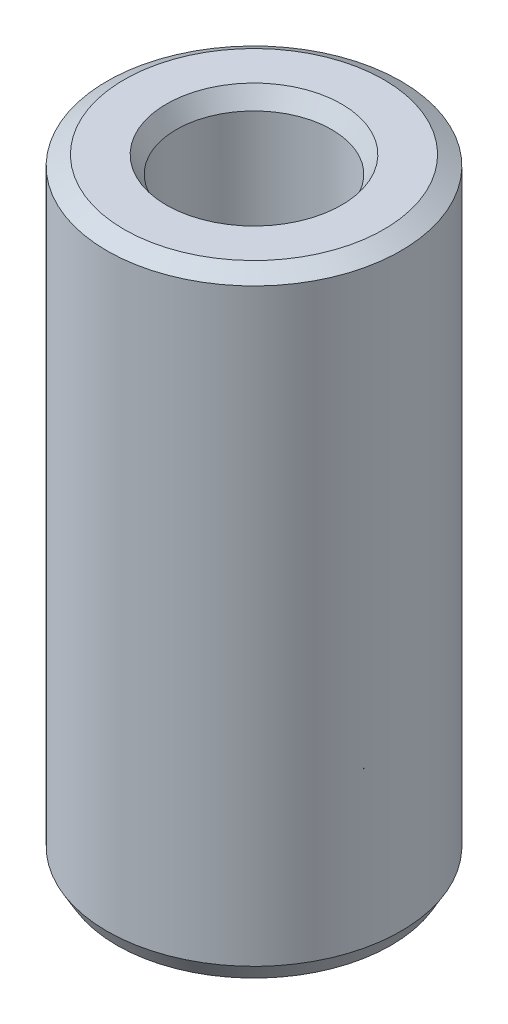
ISO-10303-21;
HEADER;
FILE_DESCRIPTION(('STEP AP214'),'2;1');
FILE_NAME('part.step','',(''),(''),'','','');
FILE_SCHEMA(('AUTOMOTIVE_DESIGN { 1 0 10303 214 1 1 1 1 }'));
ENDSEC;
DATA;
#1=APPLICATION_CONTEXT('core data for automotive mechanical design processes');
#2=APPLICATION_PROTOCOL_DEFINITION('international standard','automotive_design',2000,#1);
#3=PRODUCT_CONTEXT('',#1,'mechanical');
#4=PRODUCT('Part','Part','',(#3));
#5=PRODUCT_RELATED_PRODUCT_CATEGORY('part','',(#4));
#6=PRODUCT_DEFINITION_FORMATION('','',#4);
#7=PRODUCT_DEFINITION_CONTEXT('part definition',#1,'design');
#8=PRODUCT_DEFINITION('design','',#6,#7);
#9=PRODUCT_DEFINITION_SHAPE('','',#8);
#10=(LENGTH_UNIT() NAMED_UNIT(*) SI_UNIT(.MILLI.,.METRE.));
#11=(NAMED_UNIT(*) PLANE_ANGLE_UNIT() SI_UNIT($,.RADIAN.));
#12=(NAMED_UNIT(*) SI_UNIT($,.STERADIAN.) SOLID_ANGLE_UNIT());
#13=UNCERTAINTY_MEASURE_WITH_UNIT(LENGTH_MEASURE(1.E-05),#10,'distance_accuracy_value','');
#14=(GEOMETRIC_REPRESENTATION_CONTEXT(3) GLOBAL_UNCERTAINTY_ASSIGNED_CONTEXT((#13)) GLOBAL_UNIT_ASSIGNED_CONTEXT((#10,
#11,#12)) REPRESENTATION_CONTEXT('',''));
#15=CARTESIAN_POINT('',(0.,0.,0.));
#16=DIRECTION('',(0.,0.,1.));
#17=DIRECTION('',(1.,0.,0.));
#18=AXIS2_PLACEMENT_3D('',#15,#16,#17);
#19=CARTESIAN_POINT('',(0.,115.309120198589,0.));
#20=DIRECTION('',(0.,-1.,0.));
#21=DIRECTION('',(0.,0.,-1.));
#22=AXIS2_PLACEMENT_3D('',#19,#20,#21);
#23=CYLINDRICAL_SURFACE('',#22,27.5);
#24=CARTESIAN_POINT('',(0.,3.21119112476283,0.));
#25=DIRECTION('',(0.,1.,0.));
#26=DIRECTION('',(0.,0.,1.));
#27=AXIS2_PLACEMENT_3D('',#24,#25,#26);
#28=CIRCLE('',#27,27.5);
#29=CARTESIAN_POINT('',(0.,3.21119112476283,-27.5));
#30=VERTEX_POINT('',#29);
#31=EDGE_CURVE('E10',#30,#30,#28,.T.);
#32=CARTESIAN_POINT('',(0.,113.455138138288,0.));
#33=DIRECTION('',(0.,1.,0.));
#34=DIRECTION('',(0.,0.,1.));
#35=AXIS2_PLACEMENT_3D('',#32,#33,#34);
#36=CIRCLE('',#35,27.5);
#37=CARTESIAN_POINT('',(0.,113.455138138288,-27.5));
#38=VERTEX_POINT('',#37);
#39=EDGE_CURVE('E50',#38,#38,#36,.F.);
#40=CARTESIAN_POINT('',(0.,3.21119112476283,-27.5));
#41=CARTESIAN_POINT('',(0.,4.35956557282038,-27.5));
#42=CARTESIAN_POINT('',(0.,5.50794002087793,-27.5));
#43=CARTESIAN_POINT('',(0.,7.80468891699304,-27.5));
#44=CARTESIAN_POINT('',(0.,8.9530633650506,-27.5));
#45=CARTESIAN_POINT('',(0.,11.2498122611657,-27.5));
#46=CARTESIAN_POINT('',(0.,12.3981867092233,-27.5));
#47=CARTESIAN_POINT('',(0.,14.6949356053384,-27.5));
#48=CARTESIAN_POINT('',(0.,15.8433100533959,-27.5));
#49=CARTESIAN_POINT('',(0.,18.140058949511,-27.5));
#50=CARTESIAN_POINT('',(0.,19.2884333975686,-27.5));
#51=CARTESIAN_POINT('',(0.,21.5851822936837,-27.5));
#52=CARTESIAN_POINT('',(0.,22.7335567417412,-27.5));
#53=CARTESIAN_POINT('',(0.,25.0303056378564,-27.5));
#54=CARTESIAN_POINT('',(0.,26.1786800859139,-27.5));
#55=CARTESIAN_POINT('',(0.,28.475428982029,-27.5));
#56=CARTESIAN_POINT('',(0.,29.6238034300866,-27.5));
#57=CARTESIAN_POINT('',(0.,31.9205523262017,-27.5));
#58=CARTESIAN_POINT('',(0.,33.0689267742592,-27.5));
#59=CARTESIAN_POINT('',(0.,35.3656756703743,-27.5));
#60=CARTESIAN_POINT('',(0.,36.5140501184319,-27.5));
#61=CARTESIAN_POINT('',(0.,38.810799014547,-27.5));
#62=CARTESIAN_POINT('',(0.,39.9591734626045,-27.5));
#63=CARTESIAN_POINT('',(0.,42.2559223587197,-27.5));
#64=CARTESIAN_POINT('',(0.,43.4042968067772,-27.5));
#65=CARTESIAN_POINT('',(0.,45.7010457028923,-27.5));
#66=CARTESIAN_POINT('',(0.,46.8494201509499,-27.5));
#67=CARTESIAN_POINT('',(0.,49.146169047065,-27.5));
#68=CARTESIAN_POINT('',(0.,50.2945434951225,-27.5));
#69=CARTESIAN_POINT('',(0.,52.5912923912376,-27.5));
#70=CARTESIAN_POINT('',(0.,53.7396668392952,-27.5));
#71=CARTESIAN_POINT('',(0.,56.0364157354103,-27.5));
#72=CARTESIAN_POINT('',(0.,57.1847901834678,-27.5));
#73=CARTESIAN_POINT('',(0.,59.481539079583,-27.5));
#74=CARTESIAN_POINT('',(0.,60.6299135276405,-27.5));
#75=CARTESIAN_POINT('',(0.,62.9266624237556,-27.5));
#76=CARTESIAN_POINT('',(0.,64.0750368718132,-27.5));
#77=CARTESIAN_POINT('',(0.,66.3717857679283,-27.5));
#78=CARTESIAN_POINT('',(0.,67.5201602159858,-27.5));
#79=CARTESIAN_POINT('',(0.,69.8169091121009,-27.5));
#80=CARTESIAN_POINT('',(0.,70.9652835601585,-27.5));
#81=CARTESIAN_POINT('',(0.,73.2620324562736,-27.5));
#82=CARTESIAN_POINT('',(0.,74.4104069043311,-27.5));
#83=CARTESIAN_POINT('',(0.,76.7071558004462,-27.5));
#84=CARTESIAN_POINT('',(0.,77.8555302485038,-27.5));
#85=CARTESIAN_POINT('',(0.,80.1522791446189,-27.5));
#86=CARTESIAN_POINT('',(0.,81.3006535926765,-27.5));
#87=CARTESIAN_POINT('',(0.,83.5974024887916,-27.5));
#88=CARTESIAN_POINT('',(0.,84.7457769368491,-27.5));
#89=CARTESIAN_POINT('',(0.,87.0425258329642,-27.5));
#90=CARTESIAN_POINT('',(0.,88.1909002810218,-27.5));
#91=CARTESIAN_POINT('',(0.,90.4876491771369,-27.5));
#92=CARTESIAN_POINT('',(0.,91.6360236251944,-27.5));
#93=CARTESIAN_POINT('',(0.,93.9327725213095,-27.5));
#94=CARTESIAN_POINT('',(0.,95.0811469693671,-27.5));
#95=CARTESIAN_POINT('',(0.,97.3778958654822,-27.5));
#96=CARTESIAN_POINT('',(0.,98.5262703135398,-27.5));
#97=CARTESIAN_POINT('',(0.,100.823019209655,-27.5));
#98=CARTESIAN_POINT('',(0.,101.971393657712,-27.5));
#99=CARTESIAN_POINT('',(0.,104.268142553828,-27.5));
#100=CARTESIAN_POINT('',(0.,105.416517001885,-27.5));
#101=CARTESIAN_POINT('',(0.,107.713265898,-27.5));
#102=CARTESIAN_POINT('',(0.,108.861640346058,-27.5));
#103=CARTESIAN_POINT('',(0.,111.158389242173,-27.5));
#104=CARTESIAN_POINT('',(0.,112.30676369023,-27.5));
#105=CARTESIAN_POINT('',(0.,113.455138138288,-27.5));
#106=B_SPLINE_CURVE_WITH_KNOTS('',3,(#40,#41,#42,#43,#44,#45,#46,#47,#48,#49,#50,#51,#52,#53,
#54,#55,#56,#57,#58,#59,#60,#61,#62,#63,#64,#65,#66,#67,#68,#69,#70,#71,#72,#73,#74,#75,#76,#77,
#78,#79,#80,#81,#82,#83,#84,#85,#86,#87,#88,#89,#90,#91,#92,#93,#94,#95,#96,#97,#98,#99,#100,
#101,#102,#103,#104,#105),.UNSPECIFIED.,.F.,.F.,(4,2,2,2,2,2,2,2,2,2,2,2,2,2,2,2,2,2,2,2,2,2,2,
2,2,2,2,2,2,2,2,2,4),(0.,3.44512334417266,6.89024668834533,10.335370032518,13.7804933766906,
17.2256167208633,20.670740065036,24.1158634092086,27.5609867533813,31.0061100975539,
34.4512334417266,37.8963567858993,41.3414801300719,44.7866034742446,48.2317268184173,
51.6768501625899,55.1219735067626,58.5670968509352,62.0122201951079,65.4573435392806,
68.9024668834532,72.3475902276259,75.7927135717985,79.2378369159712,82.6829602601438,
86.1280836043165,89.5732069484892,93.0183302926618,96.4634536368345,99.9085769810071,
103.35370032518,106.798823669352,110.243947013525),.UNSPECIFIED.);
#107=EDGE_CURVE('BSEAM39',#30,#38,#106,.T.);
#108=ORIENTED_EDGE('',*,*,#31,.T.);
#109=ORIENTED_EDGE('',*,*,#39,.T.);
#110=ORIENTED_EDGE('',*,*,#107,.T.);
#111=ORIENTED_EDGE('',*,*,#107,.F.);
#112=EDGE_LOOP('',(#108,#110,#109,#111));
#113=FACE_BOUND('',#112,.T.);
#114=ADVANCED_FACE('F39',(#113),#23,.T.);
#115=CARTESIAN_POINT('',(0.,115.309120198589,0.));
#116=DIRECTION('',(0.,1.,0.));
#117=DIRECTION('',(0.,0.,1.));
#118=AXIS2_PLACEMENT_3D('',#115,#116,#117);
#119=PLANE('',#118);
#120=CARTESIAN_POINT('',(0.,115.309120198589,0.));
#121=DIRECTION('',(0.,1.,0.));
#122=DIRECTION('',(0.,0.,1.));
#123=AXIS2_PLACEMENT_3D('',#120,#121,#122);
#124=CIRCLE('',#123,16.390327319142);
#125=CARTESIAN_POINT('',(0.,115.309120198589,16.390327319142));
#126=VERTEX_POINT('',#125);
#127=EDGE_CURVE('E58',#126,#126,#124,.F.);
#128=ORIENTED_EDGE('',*,*,#127,.T.);
#129=EDGE_LOOP('',(#128));
#130=FACE_BOUND('',#129,.T.);
#131=CARTESIAN_POINT('',(0.,115.309120198589,0.));
#132=DIRECTION('',(0.,1.,0.));
#133=DIRECTION('',(0.,0.,1.));
#134=AXIS2_PLACEMENT_3D('',#131,#132,#133);
#135=CIRCLE('',#134,24.2888088752375);
#136=CARTESIAN_POINT('',(0.,115.309120198589,24.2888088752375));
#137=VERTEX_POINT('',#136);
#138=EDGE_CURVE('E61',#137,#137,#135,.T.);
#139=ORIENTED_EDGE('',*,*,#138,.T.);
#140=EDGE_LOOP('',(#139));
#141=FACE_BOUND('',#140,.T.);
#142=ADVANCED_FACE('F88',(#130,#141),#119,.T.);
#143=CARTESIAN_POINT('',(0.,0.,0.));
#144=DIRECTION('',(0.,1.,0.));
#145=DIRECTION('',(0.,0.,1.));
#146=AXIS2_PLACEMENT_3D('',#143,#144,#145);
#147=PLANE('',#146);
#148=CARTESIAN_POINT('',(0.,0.,0.));
#149=DIRECTION('',(0.,1.,0.));
#150=DIRECTION('',(0.,0.,1.));
#151=AXIS2_PLACEMENT_3D('',#148,#149,#150);
#152=CIRCLE('',#151,17.7475363836035);
#153=CARTESIAN_POINT('',(0.,0.,17.7475363836035));
#154=VERTEX_POINT('',#153);
#155=EDGE_CURVE('E51',#154,#154,#152,.T.);
#156=ORIENTED_EDGE('',*,*,#155,.T.);
#157=EDGE_LOOP('',(#156));
#158=FACE_BOUND('',#157,.T.);
#159=CARTESIAN_POINT('',(0.,0.,0.));
#160=DIRECTION('',(0.,1.,0.));
#161=DIRECTION('',(0.,0.,1.));
#162=AXIS2_PLACEMENT_3D('',#159,#160,#161);
#163=CIRCLE('',#162,25.6460179396988);
#164=CARTESIAN_POINT('',(0.,0.,25.6460179396988));
#165=VERTEX_POINT('',#164);
#166=EDGE_CURVE('E54',#165,#165,#163,.F.);
#167=ORIENTED_EDGE('',*,*,#166,.T.);
#168=EDGE_LOOP('',(#167));
#169=FACE_BOUND('',#168,.T.);
#170=ADVANCED_FACE('F83',(#158,#169),#147,.F.);
#171=CARTESIAN_POINT('',(0.,115.309120198589,0.));
#172=DIRECTION('',(0.,-1.,0.));
#173=DIRECTION('',(0.,0.,-1.));
#174=AXIS2_PLACEMENT_3D('',#171,#172,#173);
#175=CYLINDRICAL_SURFACE('',#174,14.5363452588409);
#176=CARTESIAN_POINT('',(0.,112.097929073826,0.));
#177=DIRECTION('',(0.,1.,0.));
#178=DIRECTION('',(0.,0.,1.));
#179=AXIS2_PLACEMENT_3D('',#176,#177,#178);
#180=CIRCLE('',#179,14.5363452588409);
#181=CARTESIAN_POINT('',(0.,112.097929073826,-14.5363452588409));
#182=VERTEX_POINT('',#181);
#183=EDGE_CURVE('E67',#182,#182,#180,.T.);
#184=CARTESIAN_POINT('',(0.,1.85398206030103,0.));
#185=DIRECTION('',(0.,1.,0.));
#186=DIRECTION('',(0.,0.,1.));
#187=AXIS2_PLACEMENT_3D('',#184,#185,#186);
#188=CIRCLE('',#187,14.5363452588409);
#189=CARTESIAN_POINT('',(0.,1.85398206030103,-14.5363452588409));
#190=VERTEX_POINT('',#189);
#191=EDGE_CURVE('E69',#190,#190,#188,.F.);
#192=CARTESIAN_POINT('',(0.,112.097929073826,-14.5363452588409));
#193=CARTESIAN_POINT('',(0.,110.949554625769,-14.5363452588409));
#194=CARTESIAN_POINT('',(0.,109.801180177711,-14.5363452588409));
#195=CARTESIAN_POINT('',(0.,107.504431281596,-14.5363452588409));
#196=CARTESIAN_POINT('',(0.,106.356056833539,-14.5363452588409));
#197=CARTESIAN_POINT('',(0.,104.059307937423,-14.5363452588409));
#198=CARTESIAN_POINT('',(0.,102.910933489366,-14.5363452588409));
#199=CARTESIAN_POINT('',(0.,100.614184593251,-14.5363452588409));
#200=CARTESIAN_POINT('',(0.,99.4658101451932,-14.5363452588409));
#201=CARTESIAN_POINT('',(0.,97.1690612490781,-14.5363452588409));
#202=CARTESIAN_POINT('',(0.,96.0206868010205,-14.5363452588409));
#203=CARTESIAN_POINT('',(0.,93.7239379049054,-14.5363452588409));
#204=CARTESIAN_POINT('',(0.,92.5755634568478,-14.5363452588409));
#205=CARTESIAN_POINT('',(0.,90.2788145607327,-14.5363452588409));
#206=CARTESIAN_POINT('',(0.,89.1304401126752,-14.5363452588409));
#207=CARTESIAN_POINT('',(0.,86.8336912165601,-14.5363452588409));
#208=CARTESIAN_POINT('',(0.,85.6853167685025,-14.5363452588409));
#209=CARTESIAN_POINT('',(0.,83.3885678723874,-14.5363452588409));
#210=CARTESIAN_POINT('',(0.,82.2401934243298,-14.5363452588409));
#211=CARTESIAN_POINT('',(0.,79.9434445282147,-14.5363452588409));
#212=CARTESIAN_POINT('',(0.,78.7950700801572,-14.5363452588409));
#213=CARTESIAN_POINT('',(0.,76.4983211840421,-14.5363452588409));
#214=CARTESIAN_POINT('',(0.,75.3499467359845,-14.5363452588409));
#215=CARTESIAN_POINT('',(0.,73.0531978398694,-14.5363452588409));
#216=CARTESIAN_POINT('',(0.,71.9048233918119,-14.5363452588409));
#217=CARTESIAN_POINT('',(0.,69.6080744956968,-14.5363452588409));
#218=CARTESIAN_POINT('',(0.,68.4597000476392,-14.5363452588409));
#219=CARTESIAN_POINT('',(0.,66.1629511515241,-14.5363452588409));
#220=CARTESIAN_POINT('',(0.,65.0145767034665,-14.5363452588409));
#221=CARTESIAN_POINT('',(0.,62.7178278073514,-14.5363452588409));
#222=CARTESIAN_POINT('',(0.,61.5694533592939,-14.5363452588409));
#223=CARTESIAN_POINT('',(0.,59.2727044631788,-14.5363452588409));
#224=CARTESIAN_POINT('',(0.,58.1243300151212,-14.5363452588409));
#225=CARTESIAN_POINT('',(0.,55.8275811190061,-14.5363452588409));
#226=CARTESIAN_POINT('',(0.,54.6792066709485,-14.5363452588409));
#227=CARTESIAN_POINT('',(0.,52.3824577748334,-14.5363452588409));
#228=CARTESIAN_POINT('',(0.,51.2340833267759,-14.5363452588409));
#229=CARTESIAN_POINT('',(0.,48.9373344306608,-14.5363452588409));
#230=CARTESIAN_POINT('',(0.,47.7889599826032,-14.5363452588409));
#231=CARTESIAN_POINT('',(0.,45.4922110864881,-14.5363452588409));
#232=CARTESIAN_POINT('',(0.,44.3438366384306,-14.5363452588409));
#233=CARTESIAN_POINT('',(0.,42.0470877423154,-14.5363452588409));
#234=CARTESIAN_POINT('',(0.,40.8987132942579,-14.5363452588409));
#235=CARTESIAN_POINT('',(0.,38.6019643981428,-14.5363452588409));
#236=CARTESIAN_POINT('',(0.,37.4535899500852,-14.5363452588409));
#237=CARTESIAN_POINT('',(0.,35.1568410539701,-14.5363452588409));
#238=CARTESIAN_POINT('',(0.,34.0084666059126,-14.5363452588409));
#239=CARTESIAN_POINT('',(0.,31.7117177097975,-14.5363452588409));
#240=CARTESIAN_POINT('',(0.,30.5633432617399,-14.5363452588409));
#241=CARTESIAN_POINT('',(0.,28.2665943656248,-14.5363452588409));
#242=CARTESIAN_POINT('',(0.,27.1182199175672,-14.5363452588409));
#243=CARTESIAN_POINT('',(0.,24.8214710214521,-14.5363452588409));
#244=CARTESIAN_POINT('',(0.,23.6730965733946,-14.5363452588409));
#245=CARTESIAN_POINT('',(0.,21.3763476772795,-14.5363452588409));
#246=CARTESIAN_POINT('',(0.,20.2279732292219,-14.5363452588409));
#247=CARTESIAN_POINT('',(0.,17.9312243331068,-14.5363452588409));
#248=CARTESIAN_POINT('',(0.,16.7828498850492,-14.5363452588409));
#249=CARTESIAN_POINT('',(0.,14.4861009889341,-14.5363452588409));
#250=CARTESIAN_POINT('',(0.,13.3377265408766,-14.5363452588409));
#251=CARTESIAN_POINT('',(0.,11.0409776447615,-14.5363452588409));
#252=CARTESIAN_POINT('',(0.,9.89260319670393,-14.5363452588409));
#253=CARTESIAN_POINT('',(0.,7.59585430058881,-14.5363452588409));
#254=CARTESIAN_POINT('',(0.,6.44747985253125,-14.5363452588409));
#255=CARTESIAN_POINT('',(0.,4.15073095641614,-14.5363452588409));
#256=CARTESIAN_POINT('',(0.,3.00235650835859,-14.5363452588409));
#257=CARTESIAN_POINT('',(0.,1.85398206030103,-14.5363452588409));
#258=B_SPLINE_CURVE_WITH_KNOTS('',3,(#192,#193,#194,#195,#196,#197,#198,#199,#200,#201,#202,
#203,#204,#205,#206,#207,#208,#209,#210,#211,#212,#213,#214,#215,#216,#217,#218,#219,#220,#221,
#222,#223,#224,#225,#226,#227,#228,#229,#230,#231,#232,#233,#234,#235,#236,#237,#238,#239,#240,
#241,#242,#243,#244,#245,#246,#247,#248,#249,#250,#251,#252,#253,#254,#255,#256,#257),
.UNSPECIFIED.,.F.,.F.,(4,2,2,2,2,2,2,2,2,2,2,2,2,2,2,2,2,2,2,2,2,2,2,2,2,2,2,2,2,2,2,2,4),(0.,
3.44512334417267,6.89024668834533,10.335370032518,13.7804933766907,17.2256167208633,
20.670740065036,24.1158634092087,27.5609867533813,31.006110097554,34.4512334417266,
37.8963567858993,41.341480130072,44.7866034742446,48.2317268184173,51.67685016259,
55.1219735067626,58.5670968509353,62.0122201951079,65.4573435392806,68.9024668834533,
72.3475902276259,75.7927135717986,79.2378369159713,82.6829602601439,86.1280836043166,
89.5732069484892,93.0183302926619,96.4634536368346,99.9085769810072,103.35370032518,
106.798823669353,110.243947013525),.UNSPECIFIED.);
#259=EDGE_CURVE('BSEAM71',#182,#190,#258,.T.);
#260=ORIENTED_EDGE('',*,*,#183,.T.);
#261=ORIENTED_EDGE('',*,*,#191,.T.);
#262=ORIENTED_EDGE('',*,*,#259,.T.);
#263=ORIENTED_EDGE('',*,*,#259,.F.);
#264=EDGE_LOOP('',(#260,#262,#261,#263));
#265=FACE_BOUND('',#264,.T.);
#266=ADVANCED_FACE('F71',(#265),#175,.F.);
#267=CARTESIAN_POINT('',(0.,112.097929073826,0.));
#268=DIRECTION('',(0.,1.,0.));
#269=DIRECTION('',(0.,0.,1.));
#270=AXIS2_PLACEMENT_3D('',#267,#268,#269);
#271=CONICAL_SURFACE('',#270,14.5363452588409,0.5235987755983);
#272=ORIENTED_EDGE('',*,*,#127,.F.);
#273=EDGE_LOOP('',(#272));
#274=FACE_BOUND('',#273,.T.);
#275=ORIENTED_EDGE('',*,*,#183,.F.);
#276=EDGE_LOOP('',(#275));
#277=FACE_BOUND('',#276,.T.);
#278=ADVANCED_FACE('F77',(#274,#277),#271,.F.);
#279=CARTESIAN_POINT('',(0.,0.,0.));
#280=DIRECTION('',(0.,-1.,0.));
#281=DIRECTION('',(0.,0.,-1.));
#282=AXIS2_PLACEMENT_3D('',#279,#280,#281);
#283=CONICAL_SURFACE('',#282,17.7475363836035,1.04719755119659);
#284=ORIENTED_EDGE('',*,*,#191,.F.);
#285=EDGE_LOOP('',(#284));
#286=FACE_BOUND('',#285,.T.);
#287=ORIENTED_EDGE('',*,*,#155,.F.);
#288=EDGE_LOOP('',(#287));
#289=FACE_BOUND('',#288,.T.);
#290=ADVANCED_FACE('F73',(#286,#289),#283,.F.);
#291=CARTESIAN_POINT('',(0.,3.21119112476283,0.));
#292=DIRECTION('',(0.,1.,0.));
#293=DIRECTION('',(0.,0.,1.));
#294=AXIS2_PLACEMENT_3D('',#291,#292,#293);
#295=CONICAL_SURFACE('',#294,27.5,0.523598775598302);
#296=ORIENTED_EDGE('',*,*,#166,.F.);
#297=EDGE_LOOP('',(#296));
#298=FACE_BOUND('',#297,.T.);
#299=ORIENTED_EDGE('',*,*,#31,.F.);
#300=EDGE_LOOP('',(#299));
#301=FACE_BOUND('',#300,.T.);
#302=ADVANCED_FACE('F76',(#298,#301),#295,.T.);
#303=CARTESIAN_POINT('',(0.,115.309120198589,0.));
#304=DIRECTION('',(0.,-1.,0.));
#305=DIRECTION('',(0.,0.,-1.));
#306=AXIS2_PLACEMENT_3D('',#303,#304,#305);
#307=CONICAL_SURFACE('',#306,24.2888088752375,1.0471975511966);
#308=ORIENTED_EDGE('',*,*,#39,.F.);
#309=EDGE_LOOP('',(#308));
#310=FACE_BOUND('',#309,.T.);
#311=ORIENTED_EDGE('',*,*,#138,.F.);
#312=EDGE_LOOP('',(#311));
#313=FACE_BOUND('',#312,.T.);
#314=ADVANCED_FACE('F45',(#310,#313),#307,.T.);
#315=CLOSED_SHELL('',(#114,#142,#170,#266,#278,#290,#302,#314));
#316=MANIFOLD_SOLID_BREP('B2',#315);
#317=ADVANCED_BREP_SHAPE_REPRESENTATION('',(#18,#316),#14);
#318=SHAPE_DEFINITION_REPRESENTATION(#9,#317);
ENDSEC;
END-ISO-10303-21;
